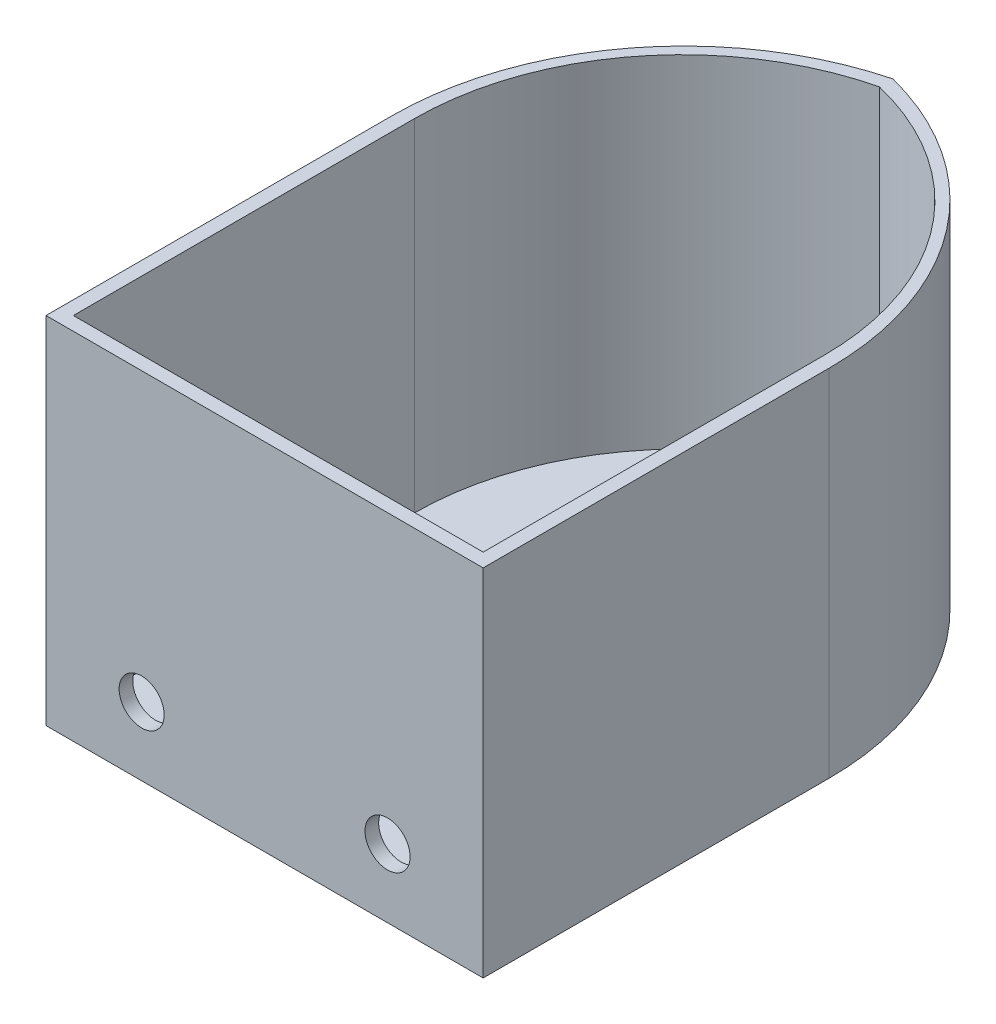
ISO-10303-21;
HEADER;
FILE_DESCRIPTION(('STEP AP214'),'2;1');
FILE_NAME('part.step','',(''),(''),'','','');
FILE_SCHEMA(('AUTOMOTIVE_DESIGN { 1 0 10303 214 1 1 1 1 }'));
ENDSEC;
DATA;
#1=APPLICATION_CONTEXT('core data for automotive mechanical design processes');
#2=APPLICATION_PROTOCOL_DEFINITION('international standard','automotive_design',2000,#1);
#3=PRODUCT_CONTEXT('',#1,'mechanical');
#4=PRODUCT('Part','Part','',(#3));
#5=PRODUCT_RELATED_PRODUCT_CATEGORY('part','',(#4));
#6=PRODUCT_DEFINITION_FORMATION('','',#4);
#7=PRODUCT_DEFINITION_CONTEXT('part definition',#1,'design');
#8=PRODUCT_DEFINITION('design','',#6,#7);
#9=PRODUCT_DEFINITION_SHAPE('','',#8);
#10=(LENGTH_UNIT() NAMED_UNIT(*) SI_UNIT(.MILLI.,.METRE.));
#11=(NAMED_UNIT(*) PLANE_ANGLE_UNIT() SI_UNIT($,.RADIAN.));
#12=(NAMED_UNIT(*) SI_UNIT($,.STERADIAN.) SOLID_ANGLE_UNIT());
#13=UNCERTAINTY_MEASURE_WITH_UNIT(LENGTH_MEASURE(1.E-05),#10,'distance_accuracy_value','');
#14=(GEOMETRIC_REPRESENTATION_CONTEXT(3) GLOBAL_UNCERTAINTY_ASSIGNED_CONTEXT((#13)) GLOBAL_UNIT_ASSIGNED_CONTEXT((#10,
#11,#12)) REPRESENTATION_CONTEXT('',''));
#15=CARTESIAN_POINT('',(0.,0.,0.));
#16=DIRECTION('',(0.,0.,1.));
#17=DIRECTION('',(1.,0.,0.));
#18=AXIS2_PLACEMENT_3D('',#15,#16,#17);
#19=CARTESIAN_POINT('',(-11.6427972092084,66.04,-65.9389501009161));
#20=DIRECTION('',(0.,-1.,0.));
#21=DIRECTION('',(0.,0.,-1.));
#22=AXIS2_PLACEMENT_3D('',#19,#20,#21);
#23=CYLINDRICAL_SURFACE('',#22,49.7427972092084);
#24=DIRECTION('',(0.,-1.,0.));
#25=VECTOR('',#24,1.);
#26=CARTESIAN_POINT('',(0.,66.04,-114.3));
#27=LINE('',#26,#25);
#28=CARTESIAN_POINT('',(0.,66.04,-114.3));
#29=VERTEX_POINT('',#28);
#30=CARTESIAN_POINT('',(0.,2.54,-114.3));
#31=VERTEX_POINT('',#30);
#32=EDGE_CURVE('E119',#29,#31,#27,.T.);
#33=ORIENTED_EDGE('',*,*,#32,.T.);
#34=CARTESIAN_POINT('',(-11.6427972092084,2.54,-65.9389501009161));
#35=DIRECTION('',(0.,-1.,0.));
#36=DIRECTION('',(0.,0.,-1.));
#37=AXIS2_PLACEMENT_3D('',#34,#35,#36);
#38=CIRCLE('',#37,49.7427972092084);
#39=CARTESIAN_POINT('',(38.1,2.54,-65.9389501009161));
#40=VERTEX_POINT('',#39);
#41=EDGE_CURVE('E110',#31,#40,#38,.T.);
#42=ORIENTED_EDGE('',*,*,#41,.T.);
#43=DIRECTION('',(0.,-1.,0.));
#44=VECTOR('',#43,1.);
#45=CARTESIAN_POINT('',(38.1,66.04,-65.9389501009161));
#46=LINE('',#45,#44);
#47=CARTESIAN_POINT('',(38.1,66.04,-65.9389501009161));
#48=VERTEX_POINT('',#47);
#49=EDGE_CURVE('E116',#48,#40,#46,.T.);
#50=ORIENTED_EDGE('',*,*,#49,.F.);
#51=CARTESIAN_POINT('',(-11.6427972092084,66.04,-65.9389501009161));
#52=DIRECTION('',(0.,1.,0.));
#53=DIRECTION('',(0.,0.,1.));
#54=AXIS2_PLACEMENT_3D('',#51,#52,#53);
#55=CIRCLE('',#54,49.7427972092084);
#56=EDGE_CURVE('E120',#48,#29,#55,.T.);
#57=ORIENTED_EDGE('',*,*,#56,.T.);
#58=EDGE_LOOP('',(#33,#42,#50,#57));
#59=FACE_BOUND('',#58,.T.);
#60=ADVANCED_FACE('F35',(#59),#23,.F.);
#61=CARTESIAN_POINT('',(11.6427972092084,66.04,-65.9389501009161));
#62=DIRECTION('',(0.,-1.,0.));
#63=DIRECTION('',(0.,0.,-1.));
#64=AXIS2_PLACEMENT_3D('',#61,#62,#63);
#65=CYLINDRICAL_SURFACE('',#64,49.7427972092084);
#66=DIRECTION('',(0.,-1.,0.));
#67=VECTOR('',#66,1.);
#68=CARTESIAN_POINT('',(-38.1,66.04,-65.9389501009161));
#69=LINE('',#68,#67);
#70=CARTESIAN_POINT('',(-38.1,66.04,-65.9389501009161));
#71=VERTEX_POINT('',#70);
#72=CARTESIAN_POINT('',(-38.1,2.54,-65.9389501009161));
#73=VERTEX_POINT('',#72);
#74=EDGE_CURVE('E135',#71,#73,#69,.T.);
#75=ORIENTED_EDGE('',*,*,#74,.T.);
#76=CARTESIAN_POINT('',(11.6427972092084,2.54,-65.9389501009161));
#77=DIRECTION('',(0.,-1.,0.));
#78=DIRECTION('',(0.,0.,-1.));
#79=AXIS2_PLACEMENT_3D('',#76,#77,#78);
#80=CIRCLE('',#79,49.7427972092084);
#81=EDGE_CURVE('E121',#73,#31,#80,.T.);
#82=ORIENTED_EDGE('',*,*,#81,.T.);
#83=ORIENTED_EDGE('',*,*,#32,.F.);
#84=CARTESIAN_POINT('',(11.6427972092084,66.04,-65.9389501009161));
#85=DIRECTION('',(0.,1.,0.));
#86=DIRECTION('',(0.,0.,-1.));
#87=AXIS2_PLACEMENT_3D('',#84,#85,#86);
#88=CIRCLE('',#87,49.7427972092084);
#89=EDGE_CURVE('E204',#29,#71,#88,.T.);
#90=ORIENTED_EDGE('',*,*,#89,.T.);
#91=EDGE_LOOP('',(#75,#82,#83,#90));
#92=FACE_BOUND('',#91,.T.);
#93=ADVANCED_FACE('F219',(#92),#65,.F.);
#94=CARTESIAN_POINT('',(-38.1,66.04,-2.53999999999999));
#95=DIRECTION('',(1.,0.,0.));
#96=DIRECTION('',(0.,0.,-1.));
#97=AXIS2_PLACEMENT_3D('',#94,#95,#96);
#98=PLANE('',#97);
#99=DIRECTION('',(0.,-1.,0.));
#100=VECTOR('',#99,1.);
#101=CARTESIAN_POINT('',(-38.1,66.04,-2.53999999999999));
#102=LINE('',#101,#100);
#103=CARTESIAN_POINT('',(-38.1,66.04,-2.53999999999999));
#104=VERTEX_POINT('',#103);
#105=CARTESIAN_POINT('',(-38.1,2.54,-2.53999999999999));
#106=VERTEX_POINT('',#105);
#107=EDGE_CURVE('E127',#104,#106,#102,.T.);
#108=ORIENTED_EDGE('',*,*,#107,.T.);
#109=DIRECTION('',(0.,0.,-1.));
#110=VECTOR('',#109,1.);
#111=CARTESIAN_POINT('',(-38.1,2.54,-2.53999999999999));
#112=LINE('',#111,#110);
#113=EDGE_CURVE('E218',#106,#73,#112,.T.);
#114=ORIENTED_EDGE('',*,*,#113,.T.);
#115=ORIENTED_EDGE('',*,*,#74,.F.);
#116=DIRECTION('',(0.,0.,1.));
#117=VECTOR('',#116,1.);
#118=CARTESIAN_POINT('',(-38.1,66.04,-2.53999999999999));
#119=LINE('',#118,#117);
#120=EDGE_CURVE('E206',#71,#104,#119,.T.);
#121=ORIENTED_EDGE('',*,*,#120,.T.);
#122=EDGE_LOOP('',(#108,#114,#115,#121));
#123=FACE_BOUND('',#122,.T.);
#124=ADVANCED_FACE('F217',(#123),#98,.T.);
#125=CARTESIAN_POINT('',(-38.1,66.04,-2.53999999999999));
#126=DIRECTION('',(0.,0.,-1.));
#127=DIRECTION('',(-1.,0.,0.));
#128=AXIS2_PLACEMENT_3D('',#125,#126,#127);
#129=PLANE('',#128);
#130=CARTESIAN_POINT('',(22.86,12.7,-2.54));
#131=DIRECTION('',(0.,0.,1.));
#132=DIRECTION('',(1.,0.,0.));
#133=AXIS2_PLACEMENT_3D('',#130,#131,#132);
#134=CIRCLE('',#133,4.191);
#135=CARTESIAN_POINT('',(27.051,12.7,-2.54));
#136=VERTEX_POINT('',#135);
#137=EDGE_CURVE('E224',#136,#136,#134,.T.);
#138=ORIENTED_EDGE('',*,*,#137,.T.);
#139=EDGE_LOOP('',(#138));
#140=FACE_BOUND('',#139,.T.);
#141=CARTESIAN_POINT('',(-22.86,12.7,-2.54));
#142=DIRECTION('',(0.,0.,1.));
#143=DIRECTION('',(1.,0.,0.));
#144=AXIS2_PLACEMENT_3D('',#141,#142,#143);
#145=CIRCLE('',#144,4.191);
#146=CARTESIAN_POINT('',(-18.669,12.7,-2.54));
#147=VERTEX_POINT('',#146);
#148=EDGE_CURVE('E228',#147,#147,#145,.T.);
#149=ORIENTED_EDGE('',*,*,#148,.T.);
#150=EDGE_LOOP('',(#149));
#151=FACE_BOUND('',#150,.T.);
#152=DIRECTION('',(0.,-1.,0.));
#153=VECTOR('',#152,1.);
#154=CARTESIAN_POINT('',(38.1,66.04,-2.53999999999999));
#155=LINE('',#154,#153);
#156=CARTESIAN_POINT('',(38.1,66.04,-2.53999999999999));
#157=VERTEX_POINT('',#156);
#158=CARTESIAN_POINT('',(38.1,2.54,-2.53999999999999));
#159=VERTEX_POINT('',#158);
#160=EDGE_CURVE('E56',#157,#159,#155,.T.);
#161=ORIENTED_EDGE('',*,*,#160,.T.);
#162=DIRECTION('',(-1.,0.,0.));
#163=VECTOR('',#162,1.);
#164=CARTESIAN_POINT('',(-38.1,2.54,-2.53999999999999));
#165=LINE('',#164,#163);
#166=EDGE_CURVE('E50',#159,#106,#165,.T.);
#167=ORIENTED_EDGE('',*,*,#166,.T.);
#168=ORIENTED_EDGE('',*,*,#107,.F.);
#169=DIRECTION('',(1.,0.,0.));
#170=VECTOR('',#169,1.);
#171=CARTESIAN_POINT('',(-38.1,66.04,-2.53999999999999));
#172=LINE('',#171,#170);
#173=EDGE_CURVE('E129',#104,#157,#172,.T.);
#174=ORIENTED_EDGE('',*,*,#173,.T.);
#175=EDGE_LOOP('',(#161,#167,#168,#174));
#176=FACE_BOUND('',#175,.T.);
#177=ADVANCED_FACE('F214',(#140,#151,#176),#129,.T.);
#178=CARTESIAN_POINT('',(38.1,66.04,-2.53999999999999));
#179=DIRECTION('',(-1.,0.,0.));
#180=DIRECTION('',(0.,0.,1.));
#181=AXIS2_PLACEMENT_3D('',#178,#179,#180);
#182=PLANE('',#181);
#183=ORIENTED_EDGE('',*,*,#49,.T.);
#184=DIRECTION('',(0.,0.,1.));
#185=VECTOR('',#184,1.);
#186=CARTESIAN_POINT('',(38.1,2.54,-2.53999999999999));
#187=LINE('',#186,#185);
#188=EDGE_CURVE('E11',#40,#159,#187,.T.);
#189=ORIENTED_EDGE('',*,*,#188,.T.);
#190=ORIENTED_EDGE('',*,*,#160,.F.);
#191=DIRECTION('',(0.,0.,-1.));
#192=VECTOR('',#191,1.);
#193=CARTESIAN_POINT('',(38.1,66.04,-2.53999999999999));
#194=LINE('',#193,#192);
#195=EDGE_CURVE('E125',#157,#48,#194,.T.);
#196=ORIENTED_EDGE('',*,*,#195,.T.);
#197=EDGE_LOOP('',(#183,#189,#190,#196));
#198=FACE_BOUND('',#197,.T.);
#199=ADVANCED_FACE('F123',(#198),#182,.T.);
#200=CARTESIAN_POINT('',(-13.6063775125185,66.04,-64.3277541499366));
#201=DIRECTION('',(0.,1.,0.));
#202=DIRECTION('',(0.,0.,1.));
#203=AXIS2_PLACEMENT_3D('',#200,#201,#202);
#204=PLANE('',#203);
#205=DIRECTION('',(0.,0.,-1.));
#206=VECTOR('',#205,1.);
#207=CARTESIAN_POINT('',(40.64,66.04,0.));
#208=LINE('',#207,#206);
#209=CARTESIAN_POINT('',(40.64,66.04,0.));
#210=VERTEX_POINT('',#209);
#211=CARTESIAN_POINT('',(40.64,66.04,-64.3277541499366));
#212=VERTEX_POINT('',#211);
#213=EDGE_CURVE('E140',#210,#212,#208,.T.);
#214=ORIENTED_EDGE('',*,*,#213,.T.);
#215=CARTESIAN_POINT('',(-13.6063775125185,66.04,-64.3277541499366));
#216=DIRECTION('',(0.,1.,0.));
#217=DIRECTION('',(0.,0.,1.));
#218=AXIS2_PLACEMENT_3D('',#215,#216,#217);
#219=CIRCLE('',#218,54.2463775125185);
#220=CARTESIAN_POINT('',(0.,66.04,-116.84));
#221=VERTEX_POINT('',#220);
#222=EDGE_CURVE('E143',#212,#221,#219,.T.);
#223=ORIENTED_EDGE('',*,*,#222,.T.);
#224=CARTESIAN_POINT('',(13.6063775125185,66.04,-64.3277541499366));
#225=DIRECTION('',(0.,1.,0.));
#226=DIRECTION('',(0.,0.,1.));
#227=AXIS2_PLACEMENT_3D('',#224,#225,#226);
#228=CIRCLE('',#227,54.2463775125185);
#229=CARTESIAN_POINT('',(-40.64,66.04,-64.3277541499366));
#230=VERTEX_POINT('',#229);
#231=EDGE_CURVE('E146',#221,#230,#228,.T.);
#232=ORIENTED_EDGE('',*,*,#231,.T.);
#233=DIRECTION('',(0.,0.,1.));
#234=VECTOR('',#233,1.);
#235=CARTESIAN_POINT('',(-40.64,66.04,-64.3277541499366));
#236=LINE('',#235,#234);
#237=CARTESIAN_POINT('',(-40.64,66.04,0.));
#238=VERTEX_POINT('',#237);
#239=EDGE_CURVE('E148',#230,#238,#236,.T.);
#240=ORIENTED_EDGE('',*,*,#239,.T.);
#241=DIRECTION('',(1.,0.,0.));
#242=VECTOR('',#241,1.);
#243=CARTESIAN_POINT('',(40.64,66.04,0.));
#244=LINE('',#243,#242);
#245=EDGE_CURVE('E150',#238,#210,#244,.T.);
#246=ORIENTED_EDGE('',*,*,#245,.T.);
#247=EDGE_LOOP('',(#214,#223,#232,#240,#246));
#248=FACE_BOUND('',#247,.T.);
#249=ORIENTED_EDGE('',*,*,#89,.F.);
#250=ORIENTED_EDGE('',*,*,#56,.F.);
#251=ORIENTED_EDGE('',*,*,#195,.F.);
#252=ORIENTED_EDGE('',*,*,#173,.F.);
#253=ORIENTED_EDGE('',*,*,#120,.F.);
#254=EDGE_LOOP('',(#249,#250,#251,#252,#253));
#255=FACE_BOUND('',#254,.T.);
#256=ADVANCED_FACE('F198',(#248,#255),#204,.T.);
#257=CARTESIAN_POINT('',(-13.6063775125185,0.,-64.3277541499366));
#258=DIRECTION('',(0.,1.,0.));
#259=DIRECTION('',(0.,0.,1.));
#260=AXIS2_PLACEMENT_3D('',#257,#258,#259);
#261=PLANE('',#260);
#262=DIRECTION('',(0.,0.,-1.));
#263=VECTOR('',#262,1.);
#264=CARTESIAN_POINT('',(40.64,0.,0.));
#265=LINE('',#264,#263);
#266=CARTESIAN_POINT('',(40.64,0.,0.));
#267=VERTEX_POINT('',#266);
#268=CARTESIAN_POINT('',(40.64,0.,-64.3277541499366));
#269=VERTEX_POINT('',#268);
#270=EDGE_CURVE('E139',#267,#269,#265,.T.);
#271=ORIENTED_EDGE('',*,*,#270,.F.);
#272=DIRECTION('',(1.,0.,0.));
#273=VECTOR('',#272,1.);
#274=CARTESIAN_POINT('',(40.64,0.,0.));
#275=LINE('',#274,#273);
#276=CARTESIAN_POINT('',(-40.64,0.,0.));
#277=VERTEX_POINT('',#276);
#278=EDGE_CURVE('E144',#277,#267,#275,.T.);
#279=ORIENTED_EDGE('',*,*,#278,.F.);
#280=DIRECTION('',(0.,0.,1.));
#281=VECTOR('',#280,1.);
#282=CARTESIAN_POINT('',(-40.64,0.,-64.3277541499366));
#283=LINE('',#282,#281);
#284=CARTESIAN_POINT('',(-40.64,0.,-64.3277541499366));
#285=VERTEX_POINT('',#284);
#286=EDGE_CURVE('E161',#285,#277,#283,.T.);
#287=ORIENTED_EDGE('',*,*,#286,.F.);
#288=CARTESIAN_POINT('',(13.6063775125185,0.,-64.3277541499366));
#289=DIRECTION('',(0.,1.,0.));
#290=DIRECTION('',(0.,0.,1.));
#291=AXIS2_PLACEMENT_3D('',#288,#289,#290);
#292=CIRCLE('',#291,54.2463775125185);
#293=CARTESIAN_POINT('',(0.,0.,-116.84));
#294=VERTEX_POINT('',#293);
#295=EDGE_CURVE('E158',#294,#285,#292,.T.);
#296=ORIENTED_EDGE('',*,*,#295,.F.);
#297=CARTESIAN_POINT('',(-13.6063775125185,0.,-64.3277541499366));
#298=DIRECTION('',(0.,1.,0.));
#299=DIRECTION('',(0.,0.,1.));
#300=AXIS2_PLACEMENT_3D('',#297,#298,#299);
#301=CIRCLE('',#300,54.2463775125185);
#302=EDGE_CURVE('E155',#269,#294,#301,.T.);
#303=ORIENTED_EDGE('',*,*,#302,.F.);
#304=EDGE_LOOP('',(#271,#279,#287,#296,#303));
#305=FACE_BOUND('',#304,.T.);
#306=ADVANCED_FACE('F182',(#305),#261,.F.);
#307=CARTESIAN_POINT('',(40.64,66.04,0.));
#308=DIRECTION('',(-1.,0.,0.));
#309=DIRECTION('',(0.,0.,1.));
#310=AXIS2_PLACEMENT_3D('',#307,#308,#309);
#311=PLANE('',#310);
#312=ORIENTED_EDGE('',*,*,#270,.T.);
#313=DIRECTION('',(0.,-1.,0.));
#314=VECTOR('',#313,1.);
#315=CARTESIAN_POINT('',(40.64,66.04,-64.3277541499366));
#316=LINE('',#315,#314);
#317=EDGE_CURVE('E43',#212,#269,#316,.T.);
#318=ORIENTED_EDGE('',*,*,#317,.F.);
#319=ORIENTED_EDGE('',*,*,#213,.F.);
#320=DIRECTION('',(0.,-1.,0.));
#321=VECTOR('',#320,1.);
#322=CARTESIAN_POINT('',(40.64,66.04,0.));
#323=LINE('',#322,#321);
#324=EDGE_CURVE('E152',#210,#267,#323,.T.);
#325=ORIENTED_EDGE('',*,*,#324,.T.);
#326=EDGE_LOOP('',(#312,#318,#319,#325));
#327=FACE_BOUND('',#326,.T.);
#328=ADVANCED_FACE('F37',(#327),#311,.F.);
#329=CARTESIAN_POINT('',(-13.6063775125185,66.04,-64.3277541499366));
#330=DIRECTION('',(0.,-1.,0.));
#331=DIRECTION('',(0.,0.,-1.));
#332=AXIS2_PLACEMENT_3D('',#329,#330,#331);
#333=CYLINDRICAL_SURFACE('',#332,54.2463775125185);
#334=ORIENTED_EDGE('',*,*,#302,.T.);
#335=DIRECTION('',(0.,-1.,0.));
#336=VECTOR('',#335,1.);
#337=CARTESIAN_POINT('',(0.,66.04,-116.84));
#338=LINE('',#337,#336);
#339=EDGE_CURVE('E171',#221,#294,#338,.T.);
#340=ORIENTED_EDGE('',*,*,#339,.F.);
#341=ORIENTED_EDGE('',*,*,#222,.F.);
#342=ORIENTED_EDGE('',*,*,#317,.T.);
#343=EDGE_LOOP('',(#334,#340,#341,#342));
#344=FACE_BOUND('',#343,.T.);
#345=ADVANCED_FACE('F175',(#344),#333,.T.);
#346=CARTESIAN_POINT('',(13.6063775125185,66.04,-64.3277541499366));
#347=DIRECTION('',(0.,-1.,0.));
#348=DIRECTION('',(0.,0.,-1.));
#349=AXIS2_PLACEMENT_3D('',#346,#347,#348);
#350=CYLINDRICAL_SURFACE('',#349,54.2463775125185);
#351=ORIENTED_EDGE('',*,*,#295,.T.);
#352=DIRECTION('',(0.,-1.,0.));
#353=VECTOR('',#352,1.);
#354=CARTESIAN_POINT('',(-40.64,66.04,-64.3277541499366));
#355=LINE('',#354,#353);
#356=EDGE_CURVE('E169',#230,#285,#355,.T.);
#357=ORIENTED_EDGE('',*,*,#356,.F.);
#358=ORIENTED_EDGE('',*,*,#231,.F.);
#359=ORIENTED_EDGE('',*,*,#339,.T.);
#360=EDGE_LOOP('',(#351,#357,#358,#359));
#361=FACE_BOUND('',#360,.T.);
#362=ADVANCED_FACE('F196',(#361),#350,.T.);
#363=CARTESIAN_POINT('',(-40.64,66.04,-64.3277541499366));
#364=DIRECTION('',(1.,0.,0.));
#365=DIRECTION('',(0.,0.,-1.));
#366=AXIS2_PLACEMENT_3D('',#363,#364,#365);
#367=PLANE('',#366);
#368=ORIENTED_EDGE('',*,*,#286,.T.);
#369=DIRECTION('',(0.,-1.,0.));
#370=VECTOR('',#369,1.);
#371=CARTESIAN_POINT('',(-40.64,66.04,0.));
#372=LINE('',#371,#370);
#373=EDGE_CURVE('E167',#238,#277,#372,.T.);
#374=ORIENTED_EDGE('',*,*,#373,.F.);
#375=ORIENTED_EDGE('',*,*,#239,.F.);
#376=ORIENTED_EDGE('',*,*,#356,.T.);
#377=EDGE_LOOP('',(#368,#374,#375,#376));
#378=FACE_BOUND('',#377,.T.);
#379=ADVANCED_FACE('F191',(#378),#367,.F.);
#380=CARTESIAN_POINT('',(40.64,66.04,0.));
#381=DIRECTION('',(0.,0.,-1.));
#382=DIRECTION('',(-1.,0.,0.));
#383=AXIS2_PLACEMENT_3D('',#380,#381,#382);
#384=PLANE('',#383);
#385=CARTESIAN_POINT('',(22.86,12.7,0.));
#386=DIRECTION('',(0.,0.,1.));
#387=DIRECTION('',(1.,0.,0.));
#388=AXIS2_PLACEMENT_3D('',#385,#386,#387);
#389=CIRCLE('',#388,4.191);
#390=CARTESIAN_POINT('',(27.051,12.7,0.));
#391=VERTEX_POINT('',#390);
#392=EDGE_CURVE('E231',#391,#391,#389,.T.);
#393=ORIENTED_EDGE('',*,*,#392,.F.);
#394=EDGE_LOOP('',(#393));
#395=FACE_BOUND('',#394,.T.);
#396=CARTESIAN_POINT('',(-22.86,12.7,0.));
#397=DIRECTION('',(0.,0.,1.));
#398=DIRECTION('',(1.,0.,0.));
#399=AXIS2_PLACEMENT_3D('',#396,#397,#398);
#400=CIRCLE('',#399,4.191);
#401=CARTESIAN_POINT('',(-18.669,12.7,0.));
#402=VERTEX_POINT('',#401);
#403=EDGE_CURVE('E225',#402,#402,#400,.T.);
#404=ORIENTED_EDGE('',*,*,#403,.F.);
#405=EDGE_LOOP('',(#404));
#406=FACE_BOUND('',#405,.T.);
#407=ORIENTED_EDGE('',*,*,#278,.T.);
#408=ORIENTED_EDGE('',*,*,#324,.F.);
#409=ORIENTED_EDGE('',*,*,#245,.F.);
#410=ORIENTED_EDGE('',*,*,#373,.T.);
#411=EDGE_LOOP('',(#407,#408,#409,#410));
#412=FACE_BOUND('',#411,.T.);
#413=ADVANCED_FACE('F188',(#395,#406,#412),#384,.F.);
#414=CARTESIAN_POINT('',(13.606377512518,2.54,-64.327754149937));
#415=DIRECTION('',(0.,-1.,0.));
#416=DIRECTION('',(0.,0.,-1.));
#417=AXIS2_PLACEMENT_3D('',#414,#415,#416);
#418=PLANE('',#417);
#419=ORIENTED_EDGE('',*,*,#41,.F.);
#420=ORIENTED_EDGE('',*,*,#81,.F.);
#421=ORIENTED_EDGE('',*,*,#113,.F.);
#422=ORIENTED_EDGE('',*,*,#166,.F.);
#423=ORIENTED_EDGE('',*,*,#188,.F.);
#424=EDGE_LOOP('',(#419,#420,#421,#422,#423));
#425=FACE_BOUND('',#424,.T.);
#426=ADVANCED_FACE('F109',(#425),#418,.F.);
#427=CARTESIAN_POINT('',(-22.86,12.7,-2.54));
#428=DIRECTION('',(0.,0.,1.));
#429=DIRECTION('',(1.,0.,0.));
#430=AXIS2_PLACEMENT_3D('',#427,#428,#429);
#431=CYLINDRICAL_SURFACE('',#430,4.191);
#432=ORIENTED_EDGE('',*,*,#148,.F.);
#433=EDGE_LOOP('',(#432));
#434=FACE_BOUND('',#433,.T.);
#435=ORIENTED_EDGE('',*,*,#403,.T.);
#436=EDGE_LOOP('',(#435));
#437=FACE_BOUND('',#436,.T.);
#438=ADVANCED_FACE('F242',(#434,#437),#431,.F.);
#439=CARTESIAN_POINT('',(22.86,12.7,-2.54));
#440=DIRECTION('',(0.,0.,1.));
#441=DIRECTION('',(1.,0.,0.));
#442=AXIS2_PLACEMENT_3D('',#439,#440,#441);
#443=CYLINDRICAL_SURFACE('',#442,4.191);
#444=ORIENTED_EDGE('',*,*,#137,.F.);
#445=EDGE_LOOP('',(#444));
#446=FACE_BOUND('',#445,.T.);
#447=ORIENTED_EDGE('',*,*,#392,.T.);
#448=EDGE_LOOP('',(#447));
#449=FACE_BOUND('',#448,.T.);
#450=ADVANCED_FACE('F239',(#446,#449),#443,.F.);
#451=CLOSED_SHELL('',(#60,#93,#124,#177,#199,#256,#306,#328,#345,#362,#379,#413,#426,#438,#450));
#452=MANIFOLD_SOLID_BREP('B2',#451);
#453=ADVANCED_BREP_SHAPE_REPRESENTATION('',(#18,#452),#14);
#454=SHAPE_DEFINITION_REPRESENTATION(#9,#453);
ENDSEC;
END-ISO-10303-21;
